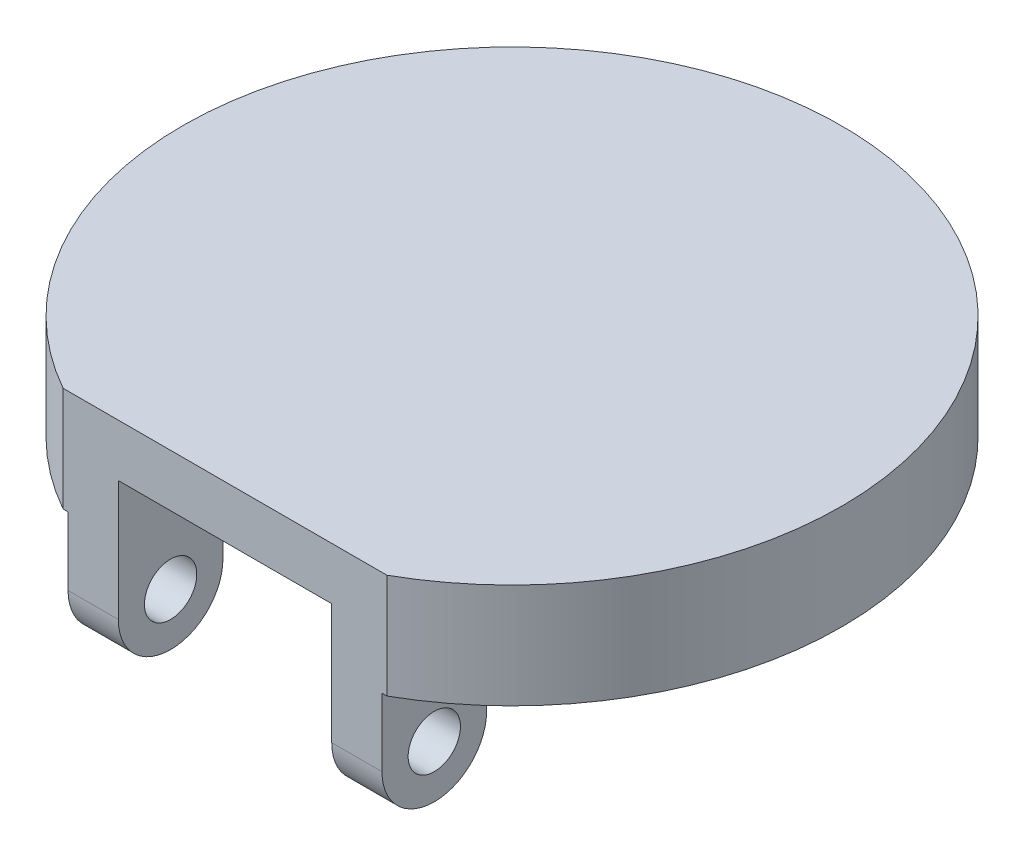
ISO-10303-21;
HEADER;
FILE_DESCRIPTION(('STEP AP214'),'2;1');
FILE_NAME('part.step','',(''),(''),'','','');
FILE_SCHEMA(('AUTOMOTIVE_DESIGN { 1 0 10303 214 1 1 1 1 }'));
ENDSEC;
DATA;
#1=APPLICATION_CONTEXT('core data for automotive mechanical design processes');
#2=APPLICATION_PROTOCOL_DEFINITION('international standard','automotive_design',2000,#1);
#3=PRODUCT_CONTEXT('',#1,'mechanical');
#4=PRODUCT('Part','Part','',(#3));
#5=PRODUCT_RELATED_PRODUCT_CATEGORY('part','',(#4));
#6=PRODUCT_DEFINITION_FORMATION('','',#4);
#7=PRODUCT_DEFINITION_CONTEXT('part definition',#1,'design');
#8=PRODUCT_DEFINITION('design','',#6,#7);
#9=PRODUCT_DEFINITION_SHAPE('','',#8);
#10=(LENGTH_UNIT() NAMED_UNIT(*) SI_UNIT(.MILLI.,.METRE.));
#11=(NAMED_UNIT(*) PLANE_ANGLE_UNIT() SI_UNIT($,.RADIAN.));
#12=(NAMED_UNIT(*) SI_UNIT($,.STERADIAN.) SOLID_ANGLE_UNIT());
#13=UNCERTAINTY_MEASURE_WITH_UNIT(LENGTH_MEASURE(1.E-05),#10,'distance_accuracy_value','');
#14=(GEOMETRIC_REPRESENTATION_CONTEXT(3) GLOBAL_UNCERTAINTY_ASSIGNED_CONTEXT((#13)) GLOBAL_UNIT_ASSIGNED_CONTEXT((#10,
#11,#12)) REPRESENTATION_CONTEXT('',''));
#15=CARTESIAN_POINT('',(0.,0.,0.));
#16=DIRECTION('',(0.,0.,1.));
#17=DIRECTION('',(1.,0.,0.));
#18=AXIS2_PLACEMENT_3D('',#15,#16,#17);
#19=CARTESIAN_POINT('',(0.,6.35,0.));
#20=DIRECTION('',(0.,-1.,0.));
#21=DIRECTION('',(0.,0.,-1.));
#22=AXIS2_PLACEMENT_3D('',#19,#20,#21);
#23=CYLINDRICAL_SURFACE('',#22,20.000000005);
#24=CARTESIAN_POINT('',(0.,6.35,0.));
#25=DIRECTION('',(0.,1.,0.));
#26=DIRECTION('',(0.,0.,1.));
#27=AXIS2_PLACEMENT_3D('',#24,#25,#26);
#28=CIRCLE('',#27,20.000000005);
#29=CARTESIAN_POINT('',(9.8255136407649,6.35,17.4200827178043));
#30=VERTEX_POINT('',#29);
#31=CARTESIAN_POINT('',(-9.8255136407649,6.35,17.4200827178043));
#32=VERTEX_POINT('',#31);
#33=EDGE_CURVE('E174',#30,#32,#28,.T.);
#34=ORIENTED_EDGE('',*,*,#33,.F.);
#35=DIRECTION('',(0.,-1.,0.));
#36=VECTOR('',#35,1.);
#37=CARTESIAN_POINT('',(9.8255136407649,6.35,17.4200827178043));
#38=LINE('',#37,#36);
#39=CARTESIAN_POINT('',(9.8255136407649,0.,17.4200827178043));
#40=VERTEX_POINT('',#39);
#41=EDGE_CURVE('E275',#30,#40,#38,.T.);
#42=ORIENTED_EDGE('',*,*,#41,.T.);
#43=CARTESIAN_POINT('',(0.,0.,0.));
#44=DIRECTION('',(0.,1.,0.));
#45=DIRECTION('',(0.,0.,1.));
#46=AXIS2_PLACEMENT_3D('',#43,#44,#45);
#47=CIRCLE('',#46,20.000000005);
#48=CARTESIAN_POINT('',(-9.8255136407649,0.,17.4200827178043));
#49=VERTEX_POINT('',#48);
#50=EDGE_CURVE('E170',#40,#49,#47,.T.);
#51=ORIENTED_EDGE('',*,*,#50,.T.);
#52=DIRECTION('',(0.,-1.,0.));
#53=VECTOR('',#52,1.);
#54=CARTESIAN_POINT('',(-9.8255136407649,6.35,17.4200827178043));
#55=LINE('',#54,#53);
#56=EDGE_CURVE('E272',#49,#32,#55,.F.);
#57=ORIENTED_EDGE('',*,*,#56,.T.);
#58=EDGE_LOOP('',(#34,#42,#51,#57));
#59=FACE_BOUND('',#58,.T.);
#60=ADVANCED_FACE('F48',(#59),#23,.T.);
#61=CARTESIAN_POINT('',(0.,6.35,0.));
#62=DIRECTION('',(0.,1.,0.));
#63=DIRECTION('',(0.,0.,1.));
#64=AXIS2_PLACEMENT_3D('',#61,#62,#63);
#65=PLANE('',#64);
#66=DIRECTION('',(-1.,0.,0.));
#67=VECTOR('',#66,1.);
#68=CARTESIAN_POINT('',(0.,6.35,17.4200827178043));
#69=LINE('',#68,#67);
#70=EDGE_CURVE('E270',#30,#32,#69,.T.);
#71=ORIENTED_EDGE('',*,*,#70,.F.);
#72=ORIENTED_EDGE('',*,*,#33,.T.);
#73=EDGE_LOOP('',(#71,#72));
#74=FACE_BOUND('',#73,.T.);
#75=ADVANCED_FACE('F315',(#74),#65,.T.);
#76=CARTESIAN_POINT('',(0.,0.,0.));
#77=DIRECTION('',(0.,1.,0.));
#78=DIRECTION('',(0.,0.,1.));
#79=AXIS2_PLACEMENT_3D('',#76,#77,#78);
#80=PLANE('',#79);
#81=CARTESIAN_POINT('',(0.,0.,0.));
#82=DIRECTION('',(0.,-1.,0.));
#83=DIRECTION('',(0.,0.,-1.));
#84=AXIS2_PLACEMENT_3D('',#81,#82,#83);
#85=CIRCLE('',#84,9.90796595497459);
#86=CARTESIAN_POINT('',(-6.477,0.,7.49775035360178));
#87=VERTEX_POINT('',#86);
#88=CARTESIAN_POINT('',(6.477,0.,7.49775035360178));
#89=VERTEX_POINT('',#88);
#90=EDGE_CURVE('E278',#87,#89,#85,.T.);
#91=ORIENTED_EDGE('',*,*,#90,.F.);
#92=DIRECTION('',(0.,0.,-1.));
#93=VECTOR('',#92,1.);
#94=CARTESIAN_POINT('',(-6.477,0.,7.89508271780427));
#95=LINE('',#94,#93);
#96=CARTESIAN_POINT('',(-6.477,0.,7.89508271780427));
#97=VERTEX_POINT('',#96);
#98=EDGE_CURVE('E251',#97,#87,#95,.T.);
#99=ORIENTED_EDGE('',*,*,#98,.F.);
#100=DIRECTION('',(1.,0.,0.));
#101=VECTOR('',#100,1.);
#102=CARTESIAN_POINT('',(-9.525,0.,7.89508271780427));
#103=LINE('',#102,#101);
#104=CARTESIAN_POINT('',(-9.525,0.,7.89508271780427));
#105=VERTEX_POINT('',#104);
#106=EDGE_CURVE('E194',#105,#97,#103,.T.);
#107=ORIENTED_EDGE('',*,*,#106,.F.);
#108=DIRECTION('',(0.,0.,1.));
#109=VECTOR('',#108,1.);
#110=CARTESIAN_POINT('',(-9.525,0.,0.));
#111=LINE('',#110,#109);
#112=CARTESIAN_POINT('',(-9.525,0.,17.4200827178043));
#113=VERTEX_POINT('',#112);
#114=EDGE_CURVE('E55',#105,#113,#111,.T.);
#115=ORIENTED_EDGE('',*,*,#114,.T.);
#116=DIRECTION('',(1.,0.,0.));
#117=VECTOR('',#116,1.);
#118=CARTESIAN_POINT('',(-20.000000005,0.,17.4200827178043));
#119=LINE('',#118,#117);
#120=EDGE_CURVE('E191',#49,#113,#119,.T.);
#121=ORIENTED_EDGE('',*,*,#120,.F.);
#122=ORIENTED_EDGE('',*,*,#50,.F.);
#123=CARTESIAN_POINT('',(9.525,0.,17.4200827178043));
#124=VERTEX_POINT('',#123);
#125=EDGE_CURVE('E268',#124,#40,#119,.T.);
#126=ORIENTED_EDGE('',*,*,#125,.F.);
#127=DIRECTION('',(0.,0.,-1.));
#128=VECTOR('',#127,1.);
#129=CARTESIAN_POINT('',(9.525,0.,0.));
#130=LINE('',#129,#128);
#131=CARTESIAN_POINT('',(9.525,0.,7.89508271780427));
#132=VERTEX_POINT('',#131);
#133=EDGE_CURVE('E181',#124,#132,#130,.T.);
#134=ORIENTED_EDGE('',*,*,#133,.T.);
#135=DIRECTION('',(-1.,0.,0.));
#136=VECTOR('',#135,1.);
#137=CARTESIAN_POINT('',(9.525,0.,7.89508271780427));
#138=LINE('',#137,#136);
#139=CARTESIAN_POINT('',(6.477,0.,7.89508271780427));
#140=VERTEX_POINT('',#139);
#141=EDGE_CURVE('E227',#132,#140,#138,.T.);
#142=ORIENTED_EDGE('',*,*,#141,.T.);
#143=DIRECTION('',(0.,0.,-1.));
#144=VECTOR('',#143,1.);
#145=CARTESIAN_POINT('',(6.477,0.,7.89508271780427));
#146=LINE('',#145,#144);
#147=EDGE_CURVE('E241',#140,#89,#146,.T.);
#148=ORIENTED_EDGE('',*,*,#147,.T.);
#149=EDGE_LOOP('',(#91,#99,#107,#115,#121,#122,#126,#134,#142,#148));
#150=FACE_BOUND('',#149,.T.);
#151=ADVANCED_FACE('F189',(#150),#80,.F.);
#152=CARTESIAN_POINT('',(9.525,-3.175,7.89508271780427));
#153=DIRECTION('',(1.,0.,0.));
#154=DIRECTION('',(0.,0.,-1.));
#155=AXIS2_PLACEMENT_3D('',#152,#153,#154);
#156=PLANE('',#155);
#157=CARTESIAN_POINT('',(9.525,-4.127,14.2450827178043));
#158=DIRECTION('',(1.,0.,0.));
#159=DIRECTION('',(0.,0.,-1.));
#160=AXIS2_PLACEMENT_3D('',#157,#158,#159);
#161=CIRCLE('',#160,1.5875);
#162=CARTESIAN_POINT('',(9.525,-4.127,12.6575827178043));
#163=VERTEX_POINT('',#162);
#164=EDGE_CURVE('E281',#163,#163,#161,.T.);
#165=ORIENTED_EDGE('',*,*,#164,.F.);
#166=EDGE_LOOP('',(#165));
#167=FACE_BOUND('',#166,.T.);
#168=ORIENTED_EDGE('',*,*,#133,.F.);
#169=DIRECTION('',(0.,-1.,0.));
#170=VECTOR('',#169,1.);
#171=CARTESIAN_POINT('',(9.525,0.,17.4200827178043));
#172=LINE('',#171,#170);
#173=CARTESIAN_POINT('',(9.525,-4.127,17.4200827178043));
#174=VERTEX_POINT('',#173);
#175=EDGE_CURVE('E219',#124,#174,#172,.T.);
#176=ORIENTED_EDGE('',*,*,#175,.T.);
#177=CARTESIAN_POINT('',(9.525,-4.127,14.2450827178043));
#178=DIRECTION('',(1.,0.,0.));
#179=DIRECTION('',(0.,0.,-1.));
#180=AXIS2_PLACEMENT_3D('',#177,#178,#179);
#181=CIRCLE('',#180,3.175);
#182=CARTESIAN_POINT('',(9.525,-4.127,11.0700827178043));
#183=VERTEX_POINT('',#182);
#184=EDGE_CURVE('E169',#174,#183,#181,.T.);
#185=ORIENTED_EDGE('',*,*,#184,.T.);
#186=DIRECTION('',(0.,1.,0.));
#187=VECTOR('',#186,1.);
#188=CARTESIAN_POINT('',(9.525,-3.175,11.0700827178043));
#189=LINE('',#188,#187);
#190=CARTESIAN_POINT('',(9.525,-3.175,11.0700827178043));
#191=VERTEX_POINT('',#190);
#192=EDGE_CURVE('E222',#183,#191,#189,.T.);
#193=ORIENTED_EDGE('',*,*,#192,.T.);
#194=CARTESIAN_POINT('',(9.525,-3.175,7.89508271780427));
#195=DIRECTION('',(-1.,0.,0.));
#196=DIRECTION('',(0.,0.,-1.));
#197=AXIS2_PLACEMENT_3D('',#194,#195,#196);
#198=CIRCLE('',#197,3.175);
#199=EDGE_CURVE('E224',#191,#132,#198,.T.);
#200=ORIENTED_EDGE('',*,*,#199,.T.);
#201=EDGE_LOOP('',(#168,#176,#185,#193,#200));
#202=FACE_BOUND('',#201,.T.);
#203=ADVANCED_FACE('F326',(#167,#202),#156,.T.);
#204=CARTESIAN_POINT('',(9.525,0.,17.4200827178043));
#205=DIRECTION('',(0.,0.,-1.));
#206=DIRECTION('',(0.,1.,0.));
#207=AXIS2_PLACEMENT_3D('',#204,#205,#206);
#208=PLANE('',#207);
#209=DIRECTION('',(1.,0.,0.));
#210=VECTOR('',#209,1.);
#211=CARTESIAN_POINT('',(-9.525,-4.127,17.4200827178043));
#212=LINE('',#211,#210);
#213=CARTESIAN_POINT('',(-9.525,-4.127,17.4200827178043));
#214=VERTEX_POINT('',#213);
#215=CARTESIAN_POINT('',(-6.477,-4.127,17.4200827178043));
#216=VERTEX_POINT('',#215);
#217=EDGE_CURVE('E205',#214,#216,#212,.T.);
#218=ORIENTED_EDGE('',*,*,#217,.T.);
#219=DIRECTION('',(0.,-1.,0.));
#220=VECTOR('',#219,1.);
#221=CARTESIAN_POINT('',(-6.477,3.175,17.4200827178043));
#222=LINE('',#221,#220);
#223=CARTESIAN_POINT('',(-6.477,3.175,17.4200827178043));
#224=VERTEX_POINT('',#223);
#225=EDGE_CURVE('E246',#224,#216,#222,.T.);
#226=ORIENTED_EDGE('',*,*,#225,.F.);
#227=DIRECTION('',(1.,0.,0.));
#228=VECTOR('',#227,1.);
#229=CARTESIAN_POINT('',(0.,3.175,17.4200827178043));
#230=LINE('',#229,#228);
#231=CARTESIAN_POINT('',(6.477,3.175,17.4200827178043));
#232=VERTEX_POINT('',#231);
#233=EDGE_CURVE('E15',#224,#232,#230,.T.);
#234=ORIENTED_EDGE('',*,*,#233,.T.);
#235=DIRECTION('',(0.,-1.,0.));
#236=VECTOR('',#235,1.);
#237=CARTESIAN_POINT('',(6.477,3.175,17.4200827178043));
#238=LINE('',#237,#236);
#239=CARTESIAN_POINT('',(6.477,-4.127,17.4200827178043));
#240=VERTEX_POINT('',#239);
#241=EDGE_CURVE('E151',#232,#240,#238,.T.);
#242=ORIENTED_EDGE('',*,*,#241,.T.);
#243=DIRECTION('',(-1.,0.,0.));
#244=VECTOR('',#243,1.);
#245=CARTESIAN_POINT('',(9.525,-4.127,17.4200827178043));
#246=LINE('',#245,#244);
#247=EDGE_CURVE('E164',#174,#240,#246,.T.);
#248=ORIENTED_EDGE('',*,*,#247,.F.);
#249=ORIENTED_EDGE('',*,*,#175,.F.);
#250=ORIENTED_EDGE('',*,*,#125,.T.);
#251=ORIENTED_EDGE('',*,*,#41,.F.);
#252=ORIENTED_EDGE('',*,*,#70,.T.);
#253=ORIENTED_EDGE('',*,*,#56,.F.);
#254=ORIENTED_EDGE('',*,*,#120,.T.);
#255=DIRECTION('',(0.,-1.,0.));
#256=VECTOR('',#255,1.);
#257=CARTESIAN_POINT('',(-9.525,0.,17.4200827178043));
#258=LINE('',#257,#256);
#259=EDGE_CURVE('E200',#113,#214,#258,.T.);
#260=ORIENTED_EDGE('',*,*,#259,.T.);
#261=EDGE_LOOP('',(#218,#226,#234,#242,#248,#249,#250,#251,#252,#253,#254,#260));
#262=FACE_BOUND('',#261,.T.);
#263=ADVANCED_FACE('F162',(#262),#208,.F.);
#264=CARTESIAN_POINT('',(9.525,-4.127,14.2450827178043));
#265=DIRECTION('',(-1.,0.,0.));
#266=DIRECTION('',(0.,0.,1.));
#267=AXIS2_PLACEMENT_3D('',#264,#265,#266);
#268=CYLINDRICAL_SURFACE('',#267,3.175);
#269=ORIENTED_EDGE('',*,*,#247,.T.);
#270=CARTESIAN_POINT('',(6.477,-4.127,14.2450827178043));
#271=DIRECTION('',(1.,0.,0.));
#272=DIRECTION('',(0.,0.,-1.));
#273=AXIS2_PLACEMENT_3D('',#270,#271,#272);
#274=CIRCLE('',#273,3.175);
#275=CARTESIAN_POINT('',(6.477,-4.127,11.0700827178043));
#276=VERTEX_POINT('',#275);
#277=EDGE_CURVE('E147',#240,#276,#274,.T.);
#278=ORIENTED_EDGE('',*,*,#277,.T.);
#279=DIRECTION('',(-1.,0.,0.));
#280=VECTOR('',#279,1.);
#281=CARTESIAN_POINT('',(9.525,-4.127,11.0700827178043));
#282=LINE('',#281,#280);
#283=EDGE_CURVE('E171',#183,#276,#282,.T.);
#284=ORIENTED_EDGE('',*,*,#283,.F.);
#285=ORIENTED_EDGE('',*,*,#184,.F.);
#286=EDGE_LOOP('',(#269,#278,#284,#285));
#287=FACE_BOUND('',#286,.T.);
#288=ADVANCED_FACE('F168',(#287),#268,.T.);
#289=CARTESIAN_POINT('',(9.525,-3.175,11.0700827178043));
#290=DIRECTION('',(0.,0.,1.));
#291=DIRECTION('',(0.,-1.,0.));
#292=AXIS2_PLACEMENT_3D('',#289,#290,#291);
#293=PLANE('',#292);
#294=ORIENTED_EDGE('',*,*,#283,.T.);
#295=DIRECTION('',(0.,1.,0.));
#296=VECTOR('',#295,1.);
#297=CARTESIAN_POINT('',(6.477,-4.127,11.0700827178043));
#298=LINE('',#297,#296);
#299=CARTESIAN_POINT('',(6.477,-3.175,11.0700827178043));
#300=VERTEX_POINT('',#299);
#301=EDGE_CURVE('E153',#276,#300,#298,.T.);
#302=ORIENTED_EDGE('',*,*,#301,.T.);
#303=DIRECTION('',(-1.,0.,0.));
#304=VECTOR('',#303,1.);
#305=CARTESIAN_POINT('',(9.525,-3.175,11.0700827178043));
#306=LINE('',#305,#304);
#307=EDGE_CURVE('E176',#191,#300,#306,.T.);
#308=ORIENTED_EDGE('',*,*,#307,.F.);
#309=ORIENTED_EDGE('',*,*,#192,.F.);
#310=EDGE_LOOP('',(#294,#302,#308,#309));
#311=FACE_BOUND('',#310,.T.);
#312=ADVANCED_FACE('F239',(#311),#293,.F.);
#313=CARTESIAN_POINT('',(9.525,-3.175,7.89508271780427));
#314=DIRECTION('',(-1.,0.,0.));
#315=DIRECTION('',(0.,0.,1.));
#316=AXIS2_PLACEMENT_3D('',#313,#314,#315);
#317=CYLINDRICAL_SURFACE('',#316,3.175);
#318=ORIENTED_EDGE('',*,*,#307,.T.);
#319=CARTESIAN_POINT('',(6.477,-3.175,7.89508271780427));
#320=DIRECTION('',(1.,0.,0.));
#321=DIRECTION('',(0.,0.,-1.));
#322=AXIS2_PLACEMENT_3D('',#319,#320,#321);
#323=CIRCLE('',#322,3.175);
#324=EDGE_CURVE('E236',#300,#140,#323,.F.);
#325=ORIENTED_EDGE('',*,*,#324,.T.);
#326=ORIENTED_EDGE('',*,*,#141,.F.);
#327=ORIENTED_EDGE('',*,*,#199,.F.);
#328=EDGE_LOOP('',(#318,#325,#326,#327));
#329=FACE_BOUND('',#328,.T.);
#330=ADVANCED_FACE('F234',(#329),#317,.F.);
#331=CARTESIAN_POINT('',(-9.525,-3.175,7.89508271780427));
#332=DIRECTION('',(-1.,0.,0.));
#333=DIRECTION('',(0.,0.,-1.));
#334=AXIS2_PLACEMENT_3D('',#331,#332,#333);
#335=PLANE('',#334);
#336=CARTESIAN_POINT('',(-9.525,-4.127,14.2450827178043));
#337=DIRECTION('',(-1.,0.,0.));
#338=DIRECTION('',(0.,0.,1.));
#339=AXIS2_PLACEMENT_3D('',#336,#337,#338);
#340=CIRCLE('',#339,1.5875);
#341=CARTESIAN_POINT('',(-9.525,-4.127,15.8325827178043));
#342=VERTEX_POINT('',#341);
#343=EDGE_CURVE('E286',#342,#342,#340,.T.);
#344=ORIENTED_EDGE('',*,*,#343,.F.);
#345=EDGE_LOOP('',(#344));
#346=FACE_BOUND('',#345,.T.);
#347=ORIENTED_EDGE('',*,*,#114,.F.);
#348=CARTESIAN_POINT('',(-9.525,-3.175,7.89508271780427));
#349=DIRECTION('',(-1.,0.,0.));
#350=DIRECTION('',(0.,0.,-1.));
#351=AXIS2_PLACEMENT_3D('',#348,#349,#350);
#352=CIRCLE('',#351,3.175);
#353=CARTESIAN_POINT('',(-9.525,-3.175,11.0700827178043));
#354=VERTEX_POINT('',#353);
#355=EDGE_CURVE('E289',#354,#105,#352,.T.);
#356=ORIENTED_EDGE('',*,*,#355,.F.);
#357=DIRECTION('',(0.,1.,0.));
#358=VECTOR('',#357,1.);
#359=CARTESIAN_POINT('',(-9.525,-3.175,11.0700827178043));
#360=LINE('',#359,#358);
#361=CARTESIAN_POINT('',(-9.525,-4.127,11.0700827178043));
#362=VERTEX_POINT('',#361);
#363=EDGE_CURVE('E209',#362,#354,#360,.T.);
#364=ORIENTED_EDGE('',*,*,#363,.F.);
#365=CARTESIAN_POINT('',(-9.525,-4.127,14.2450827178043));
#366=DIRECTION('',(1.,0.,0.));
#367=DIRECTION('',(0.,0.,-1.));
#368=AXIS2_PLACEMENT_3D('',#365,#366,#367);
#369=CIRCLE('',#368,3.175);
#370=EDGE_CURVE('E204',#214,#362,#369,.T.);
#371=ORIENTED_EDGE('',*,*,#370,.F.);
#372=ORIENTED_EDGE('',*,*,#259,.F.);
#373=EDGE_LOOP('',(#347,#356,#364,#371,#372));
#374=FACE_BOUND('',#373,.T.);
#375=ADVANCED_FACE('F201',(#346,#374),#335,.T.);
#376=CARTESIAN_POINT('',(-9.525,-3.175,7.89508271780427));
#377=DIRECTION('',(1.,0.,0.));
#378=DIRECTION('',(0.,0.,-1.));
#379=AXIS2_PLACEMENT_3D('',#376,#377,#378);
#380=CYLINDRICAL_SURFACE('',#379,3.175);
#381=CARTESIAN_POINT('',(-6.477,-3.175,7.89508271780427));
#382=DIRECTION('',(-1.,0.,0.));
#383=DIRECTION('',(0.,0.,1.));
#384=AXIS2_PLACEMENT_3D('',#381,#382,#383);
#385=CIRCLE('',#384,3.175);
#386=CARTESIAN_POINT('',(-6.477,-3.175,11.0700827178043));
#387=VERTEX_POINT('',#386);
#388=EDGE_CURVE('E253',#387,#97,#385,.T.);
#389=ORIENTED_EDGE('',*,*,#388,.F.);
#390=DIRECTION('',(1.,0.,0.));
#391=VECTOR('',#390,1.);
#392=CARTESIAN_POINT('',(-9.525,-3.175,11.0700827178043));
#393=LINE('',#392,#391);
#394=EDGE_CURVE('E215',#354,#387,#393,.T.);
#395=ORIENTED_EDGE('',*,*,#394,.F.);
#396=ORIENTED_EDGE('',*,*,#355,.T.);
#397=ORIENTED_EDGE('',*,*,#106,.T.);
#398=EDGE_LOOP('',(#389,#395,#396,#397));
#399=FACE_BOUND('',#398,.T.);
#400=ADVANCED_FACE('F330',(#399),#380,.F.);
#401=CARTESIAN_POINT('',(-9.525,-3.175,11.0700827178043));
#402=DIRECTION('',(0.,0.,-1.));
#403=DIRECTION('',(0.,1.,0.));
#404=AXIS2_PLACEMENT_3D('',#401,#402,#403);
#405=PLANE('',#404);
#406=DIRECTION('',(0.,1.,0.));
#407=VECTOR('',#406,1.);
#408=CARTESIAN_POINT('',(-6.477,-4.127,11.0700827178043));
#409=LINE('',#408,#407);
#410=CARTESIAN_POINT('',(-6.477,-4.127,11.0700827178043));
#411=VERTEX_POINT('',#410);
#412=EDGE_CURVE('E255',#411,#387,#409,.T.);
#413=ORIENTED_EDGE('',*,*,#412,.F.);
#414=DIRECTION('',(1.,0.,0.));
#415=VECTOR('',#414,1.);
#416=CARTESIAN_POINT('',(-9.525,-4.127,11.0700827178043));
#417=LINE('',#416,#415);
#418=EDGE_CURVE('E207',#362,#411,#417,.T.);
#419=ORIENTED_EDGE('',*,*,#418,.F.);
#420=ORIENTED_EDGE('',*,*,#363,.T.);
#421=ORIENTED_EDGE('',*,*,#394,.T.);
#422=EDGE_LOOP('',(#413,#419,#420,#421));
#423=FACE_BOUND('',#422,.T.);
#424=ADVANCED_FACE('F293',(#423),#405,.T.);
#425=CARTESIAN_POINT('',(-9.525,-4.127,14.2450827178043));
#426=DIRECTION('',(1.,0.,0.));
#427=DIRECTION('',(0.,0.,-1.));
#428=AXIS2_PLACEMENT_3D('',#425,#426,#427);
#429=CYLINDRICAL_SURFACE('',#428,3.175);
#430=CARTESIAN_POINT('',(-6.477,-4.127,14.2450827178043));
#431=DIRECTION('',(-1.,0.,0.));
#432=DIRECTION('',(0.,0.,1.));
#433=AXIS2_PLACEMENT_3D('',#430,#431,#432);
#434=CIRCLE('',#433,3.175);
#435=EDGE_CURVE('E248',#216,#411,#434,.F.);
#436=ORIENTED_EDGE('',*,*,#435,.F.);
#437=ORIENTED_EDGE('',*,*,#217,.F.);
#438=ORIENTED_EDGE('',*,*,#370,.T.);
#439=ORIENTED_EDGE('',*,*,#418,.T.);
#440=EDGE_LOOP('',(#436,#437,#438,#439));
#441=FACE_BOUND('',#440,.T.);
#442=ADVANCED_FACE('F296',(#441),#429,.T.);
#443=CARTESIAN_POINT('',(-20.000000005,-4.127,14.2450827178043));
#444=DIRECTION('',(1.,0.,0.));
#445=DIRECTION('',(0.,0.,-1.));
#446=AXIS2_PLACEMENT_3D('',#443,#444,#445);
#447=CYLINDRICAL_SURFACE('',#446,1.5875);
#448=CARTESIAN_POINT('',(-6.477,-4.127,14.2450827178043));
#449=DIRECTION('',(-1.,0.,0.));
#450=DIRECTION('',(0.,0.,1.));
#451=AXIS2_PLACEMENT_3D('',#448,#449,#450);
#452=CIRCLE('',#451,1.5875);
#453=CARTESIAN_POINT('',(-6.477,-4.127,15.8325827178043));
#454=VERTEX_POINT('',#453);
#455=EDGE_CURVE('E265',#454,#454,#452,.F.);
#456=ORIENTED_EDGE('',*,*,#455,.T.);
#457=EDGE_LOOP('',(#456));
#458=FACE_BOUND('',#457,.T.);
#459=ORIENTED_EDGE('',*,*,#343,.T.);
#460=EDGE_LOOP('',(#459));
#461=FACE_BOUND('',#460,.T.);
#462=ADVANCED_FACE('F402',(#458,#461),#447,.F.);
#463=CARTESIAN_POINT('',(6.477,-4.127,14.2450827178043));
#464=DIRECTION('',(1.,0.,0.));
#465=DIRECTION('',(0.,0.,-1.));
#466=AXIS2_PLACEMENT_3D('',#463,#464,#465);
#467=CIRCLE('',#466,1.5875);
#468=CARTESIAN_POINT('',(6.477,-4.127,12.6575827178043));
#469=VERTEX_POINT('',#468);
#470=EDGE_CURVE('E259',#469,#469,#467,.F.);
#471=ORIENTED_EDGE('',*,*,#470,.T.);
#472=EDGE_LOOP('',(#471));
#473=FACE_BOUND('',#472,.T.);
#474=ORIENTED_EDGE('',*,*,#164,.T.);
#475=EDGE_LOOP('',(#474));
#476=FACE_BOUND('',#475,.T.);
#477=ADVANCED_FACE('F311',(#473,#476),#447,.F.);
#478=CARTESIAN_POINT('',(0.,3.175,0.));
#479=DIRECTION('',(0.,-1.,0.));
#480=DIRECTION('',(0.,0.,-1.));
#481=AXIS2_PLACEMENT_3D('',#478,#479,#480);
#482=CYLINDRICAL_SURFACE('',#481,9.90796595497459);
#483=CARTESIAN_POINT('',(0.,3.175,0.));
#484=DIRECTION('',(0.,-1.,0.));
#485=DIRECTION('',(0.,0.,-1.));
#486=AXIS2_PLACEMENT_3D('',#483,#484,#485);
#487=CIRCLE('',#486,9.90796595497459);
#488=CARTESIAN_POINT('',(-6.477,3.175,7.49775035360178));
#489=VERTEX_POINT('',#488);
#490=CARTESIAN_POINT('',(6.477,3.175,7.49775035360178));
#491=VERTEX_POINT('',#490);
#492=EDGE_CURVE('E279',#489,#491,#487,.T.);
#493=ORIENTED_EDGE('',*,*,#492,.F.);
#494=DIRECTION('',(0.,-1.,0.));
#495=VECTOR('',#494,1.);
#496=CARTESIAN_POINT('',(-6.477,3.175,7.49775035360178));
#497=LINE('',#496,#495);
#498=EDGE_CURVE('E262',#489,#87,#497,.T.);
#499=ORIENTED_EDGE('',*,*,#498,.T.);
#500=ORIENTED_EDGE('',*,*,#90,.T.);
#501=DIRECTION('',(0.,-1.,0.));
#502=VECTOR('',#501,1.);
#503=CARTESIAN_POINT('',(6.477,3.175,7.49775035360178));
#504=LINE('',#503,#502);
#505=EDGE_CURVE('E250',#89,#491,#504,.F.);
#506=ORIENTED_EDGE('',*,*,#505,.T.);
#507=EDGE_LOOP('',(#493,#499,#500,#506));
#508=FACE_BOUND('',#507,.T.);
#509=ADVANCED_FACE('F302',(#508),#482,.F.);
#510=CARTESIAN_POINT('',(0.,3.175,0.));
#511=DIRECTION('',(0.,-1.,0.));
#512=DIRECTION('',(0.,0.,-1.));
#513=AXIS2_PLACEMENT_3D('',#510,#511,#512);
#514=PLANE('',#513);
#515=DIRECTION('',(0.,0.,1.));
#516=VECTOR('',#515,1.);
#517=CARTESIAN_POINT('',(6.477,3.175,6.64691441161835));
#518=LINE('',#517,#516);
#519=EDGE_CURVE('E62',#491,#232,#518,.T.);
#520=ORIENTED_EDGE('',*,*,#519,.T.);
#521=ORIENTED_EDGE('',*,*,#233,.F.);
#522=DIRECTION('',(0.,0.,1.));
#523=VECTOR('',#522,1.);
#524=CARTESIAN_POINT('',(-6.477,3.175,6.64691441161835));
#525=LINE('',#524,#523);
#526=EDGE_CURVE('E70',#489,#224,#525,.T.);
#527=ORIENTED_EDGE('',*,*,#526,.F.);
#528=ORIENTED_EDGE('',*,*,#492,.T.);
#529=EDGE_LOOP('',(#520,#521,#527,#528));
#530=FACE_BOUND('',#529,.T.);
#531=ADVANCED_FACE('F303',(#530),#514,.T.);
#532=CARTESIAN_POINT('',(6.477,-3.175,7.89508271780427));
#533=DIRECTION('',(1.,0.,0.));
#534=DIRECTION('',(0.,0.,-1.));
#535=AXIS2_PLACEMENT_3D('',#532,#533,#534);
#536=PLANE('',#535);
#537=ORIENTED_EDGE('',*,*,#147,.F.);
#538=ORIENTED_EDGE('',*,*,#324,.F.);
#539=ORIENTED_EDGE('',*,*,#301,.F.);
#540=ORIENTED_EDGE('',*,*,#277,.F.);
#541=ORIENTED_EDGE('',*,*,#241,.F.);
#542=ORIENTED_EDGE('',*,*,#519,.F.);
#543=ORIENTED_EDGE('',*,*,#505,.F.);
#544=EDGE_LOOP('',(#537,#538,#539,#540,#541,#542,#543));
#545=FACE_BOUND('',#544,.T.);
#546=ORIENTED_EDGE('',*,*,#470,.F.);
#547=EDGE_LOOP('',(#546));
#548=FACE_BOUND('',#547,.T.);
#549=ADVANCED_FACE('F149',(#545,#548),#536,.F.);
#550=CARTESIAN_POINT('',(-6.477,-3.175,7.89508271780427));
#551=DIRECTION('',(-1.,0.,0.));
#552=DIRECTION('',(0.,0.,-1.));
#553=AXIS2_PLACEMENT_3D('',#550,#551,#552);
#554=PLANE('',#553);
#555=ORIENTED_EDGE('',*,*,#526,.T.);
#556=ORIENTED_EDGE('',*,*,#225,.T.);
#557=ORIENTED_EDGE('',*,*,#435,.T.);
#558=ORIENTED_EDGE('',*,*,#412,.T.);
#559=ORIENTED_EDGE('',*,*,#388,.T.);
#560=ORIENTED_EDGE('',*,*,#98,.T.);
#561=ORIENTED_EDGE('',*,*,#498,.F.);
#562=EDGE_LOOP('',(#555,#556,#557,#558,#559,#560,#561));
#563=FACE_BOUND('',#562,.T.);
#564=ORIENTED_EDGE('',*,*,#455,.F.);
#565=EDGE_LOOP('',(#564));
#566=FACE_BOUND('',#565,.T.);
#567=ADVANCED_FACE('F298',(#563,#566),#554,.F.);
#568=CLOSED_SHELL('',(#60,#75,#151,#203,#263,#288,#312,#330,#375,#400,#424,#442,#462,#477,#509,
#531,#549,#567));
#569=MANIFOLD_SOLID_BREP('B2',#568);
#570=ADVANCED_BREP_SHAPE_REPRESENTATION('',(#18,#569),#14);
#571=SHAPE_DEFINITION_REPRESENTATION(#9,#570);
ENDSEC;
END-ISO-10303-21;
